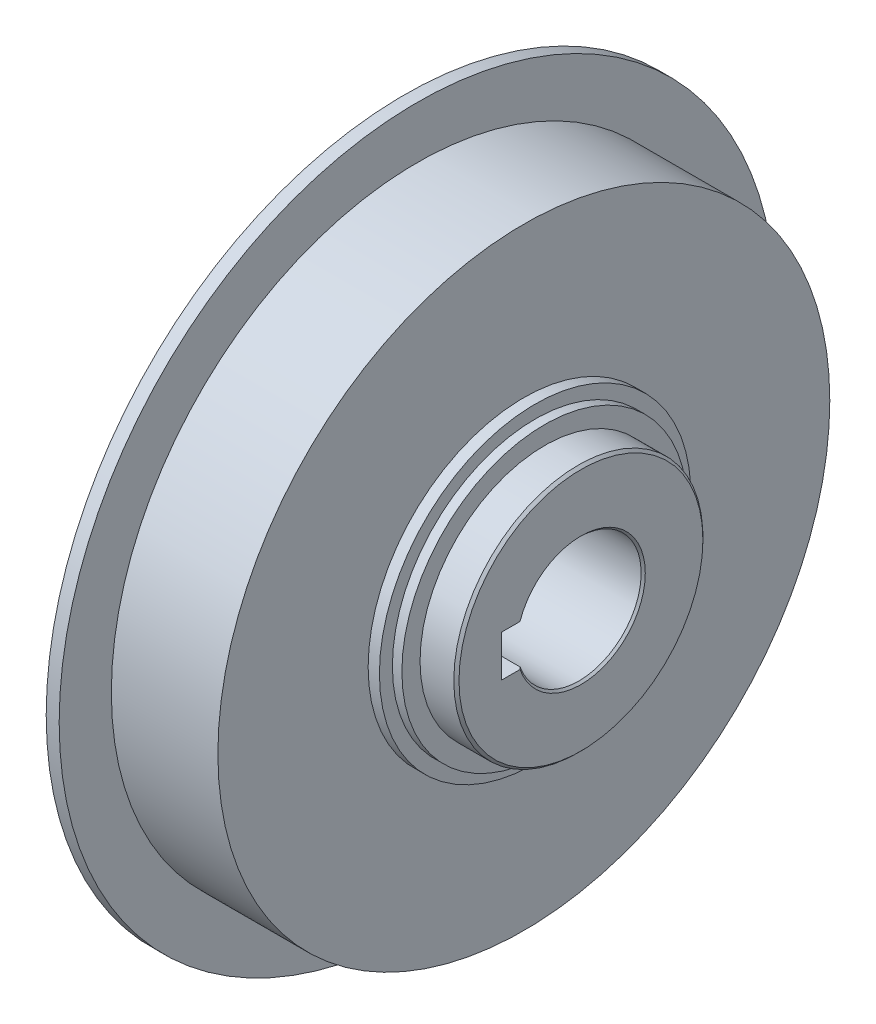
ISO-10303-21;
HEADER;
FILE_DESCRIPTION(('STEP AP214'),'2;1');
FILE_NAME('part.step','',(''),(''),'','','');
FILE_SCHEMA(('AUTOMOTIVE_DESIGN { 1 0 10303 214 1 1 1 1 }'));
ENDSEC;
DATA;
#1=APPLICATION_CONTEXT('core data for automotive mechanical design processes');
#2=APPLICATION_PROTOCOL_DEFINITION('international standard','automotive_design',2000,#1);
#3=PRODUCT_CONTEXT('',#1,'mechanical');
#4=PRODUCT('Part','Part','',(#3));
#5=PRODUCT_RELATED_PRODUCT_CATEGORY('part','',(#4));
#6=PRODUCT_DEFINITION_FORMATION('','',#4);
#7=PRODUCT_DEFINITION_CONTEXT('part definition',#1,'design');
#8=PRODUCT_DEFINITION('design','',#6,#7);
#9=PRODUCT_DEFINITION_SHAPE('','',#8);
#10=(LENGTH_UNIT() NAMED_UNIT(*) SI_UNIT(.MILLI.,.METRE.));
#11=(NAMED_UNIT(*) PLANE_ANGLE_UNIT() SI_UNIT($,.RADIAN.));
#12=(NAMED_UNIT(*) SI_UNIT($,.STERADIAN.) SOLID_ANGLE_UNIT());
#13=UNCERTAINTY_MEASURE_WITH_UNIT(LENGTH_MEASURE(1.E-05),#10,'distance_accuracy_value','');
#14=(GEOMETRIC_REPRESENTATION_CONTEXT(3) GLOBAL_UNCERTAINTY_ASSIGNED_CONTEXT((#13)) GLOBAL_UNIT_ASSIGNED_CONTEXT((#10,
#11,#12)) REPRESENTATION_CONTEXT('',''));
#15=CARTESIAN_POINT('',(0.,0.,0.));
#16=DIRECTION('',(0.,0.,1.));
#17=DIRECTION('',(1.,0.,0.));
#18=AXIS2_PLACEMENT_3D('',#15,#16,#17);
#19=CARTESIAN_POINT('',(83.1,0.,0.));
#20=DIRECTION('',(1.,0.,0.));
#21=DIRECTION('',(0.,0.,-1.));
#22=AXIS2_PLACEMENT_3D('',#19,#20,#21);
#23=CONICAL_SURFACE('',#22,12.4,0.78539816339744);
#24=CARTESIAN_POINT('',(82.7,0.,0.));
#25=DIRECTION('',(-1.,0.,0.));
#26=DIRECTION('',(0.,0.,1.));
#27=AXIS2_PLACEMENT_3D('',#24,#25,#26);
#28=CIRCLE('',#27,12.);
#29=CARTESIAN_POINT('',(82.7,4.,11.3137084989848));
#30=VERTEX_POINT('',#29);
#31=CARTESIAN_POINT('',(82.7,-4.,11.3137084989848));
#32=VERTEX_POINT('',#31);
#33=EDGE_CURVE('E79',#30,#32,#28,.T.);
#34=ORIENTED_EDGE('',*,*,#33,.T.);
#35=CARTESIAN_POINT('',(83.1,-4.,11.737120600897));
#36=CARTESIAN_POINT('',(83.0332637530497,-4.,11.6666176506962));
#37=CARTESIAN_POINT('',(82.9665622963739,-4.,11.5960818339105));
#38=CARTESIAN_POINT('',(82.83322896304,-4.,11.454944466607));
#39=CARTESIAN_POINT('',(82.7665970863825,-4.,11.3843429160886));
#40=CARTESIAN_POINT('',(82.7,-4.,11.3137084989848));
#41=B_SPLINE_CURVE_WITH_KNOTS('',3,(#35,#36,#37,#38,#39,#40),.UNSPECIFIED.,.F.,.F.,(4,2,4),(0.,
0.291237827128769,0.582475656578388),.UNSPECIFIED.);
#42=CARTESIAN_POINT('',(83.1,-4.,11.737120600897));
#43=VERTEX_POINT('',#42);
#44=EDGE_CURVE('E74',#43,#32,#41,.T.);
#45=ORIENTED_EDGE('',*,*,#44,.F.);
#46=CARTESIAN_POINT('',(83.1,0.,0.));
#47=DIRECTION('',(1.,0.,0.));
#48=DIRECTION('',(0.,0.,-1.));
#49=AXIS2_PLACEMENT_3D('',#46,#47,#48);
#50=CIRCLE('',#49,12.4);
#51=CARTESIAN_POINT('',(83.1,4.,11.737120600897));
#52=VERTEX_POINT('',#51);
#53=EDGE_CURVE('E72',#52,#43,#50,.F.);
#54=ORIENTED_EDGE('',*,*,#53,.F.);
#55=CARTESIAN_POINT('',(82.7,4.,11.3137084989848));
#56=CARTESIAN_POINT('',(82.7665970863825,4.,11.3843429160886));
#57=CARTESIAN_POINT('',(82.83322896304,4.,11.454944466607));
#58=CARTESIAN_POINT('',(82.9665622963739,4.,11.5960818339105));
#59=CARTESIAN_POINT('',(83.0332637530497,4.,11.6666176506962));
#60=CARTESIAN_POINT('',(83.1,4.,11.737120600897));
#61=B_SPLINE_CURVE_WITH_KNOTS('',3,(#55,#56,#57,#58,#59,#60),.UNSPECIFIED.,.F.,.F.,(4,2,4),(0.,
0.291237829449622,0.582475656578395),.UNSPECIFIED.);
#62=EDGE_CURVE('E20',#30,#52,#61,.T.);
#63=ORIENTED_EDGE('',*,*,#62,.F.);
#64=EDGE_LOOP('',(#34,#45,#54,#63));
#65=FACE_BOUND('',#64,.T.);
#66=ADVANCED_FACE('F16',(#65),#23,.F.);
#67=CARTESIAN_POINT('',(60.8,0.,0.));
#68=DIRECTION('',(-1.,0.,0.));
#69=DIRECTION('',(0.,0.,1.));
#70=AXIS2_PLACEMENT_3D('',#67,#68,#69);
#71=CYLINDRICAL_SURFACE('',#70,12.);
#72=ORIENTED_EDGE('',*,*,#33,.F.);
#73=DIRECTION('',(1.,0.,0.));
#74=VECTOR('',#73,1.);
#75=CARTESIAN_POINT('',(60.8,4.,11.3137084989848));
#76=LINE('',#75,#74);
#77=CARTESIAN_POINT('',(38.9,4.,11.3137084989848));
#78=VERTEX_POINT('',#77);
#79=EDGE_CURVE('E87',#78,#30,#76,.T.);
#80=ORIENTED_EDGE('',*,*,#79,.F.);
#81=CARTESIAN_POINT('',(38.9,0.,0.));
#82=DIRECTION('',(-1.,0.,0.));
#83=DIRECTION('',(0.,0.,1.));
#84=AXIS2_PLACEMENT_3D('',#81,#82,#83);
#85=CIRCLE('',#84,12.);
#86=CARTESIAN_POINT('',(38.9,-4.,11.3137084989848));
#87=VERTEX_POINT('',#86);
#88=EDGE_CURVE('E93',#78,#87,#85,.T.);
#89=ORIENTED_EDGE('',*,*,#88,.T.);
#90=DIRECTION('',(1.,0.,0.));
#91=VECTOR('',#90,1.);
#92=CARTESIAN_POINT('',(60.8,-4.,11.3137084989848));
#93=LINE('',#92,#91);
#94=EDGE_CURVE('E78',#32,#87,#93,.F.);
#95=ORIENTED_EDGE('',*,*,#94,.F.);
#96=EDGE_LOOP('',(#72,#80,#89,#95));
#97=FACE_BOUND('',#96,.T.);
#98=ADVANCED_FACE('F307',(#97),#71,.F.);
#99=CARTESIAN_POINT('',(83.1,0.,17.95));
#100=DIRECTION('',(1.,0.,0.));
#101=DIRECTION('',(0.,0.,-1.));
#102=AXIS2_PLACEMENT_3D('',#99,#100,#101);
#103=PLANE('',#102);
#104=DIRECTION('',(0.,0.,-1.));
#105=VECTOR('',#104,1.);
#106=CARTESIAN_POINT('',(83.1,4.,7.65));
#107=LINE('',#106,#105);
#108=CARTESIAN_POINT('',(83.1,4.,15.3));
#109=VERTEX_POINT('',#108);
#110=EDGE_CURVE('E84',#52,#109,#107,.F.);
#111=ORIENTED_EDGE('',*,*,#110,.F.);
#112=ORIENTED_EDGE('',*,*,#53,.T.);
#113=DIRECTION('',(0.,0.,1.));
#114=VECTOR('',#113,1.);
#115=CARTESIAN_POINT('',(83.1,-4.,7.65));
#116=LINE('',#115,#114);
#117=CARTESIAN_POINT('',(83.1,-4.,15.3));
#118=VERTEX_POINT('',#117);
#119=EDGE_CURVE('E109',#118,#43,#116,.F.);
#120=ORIENTED_EDGE('',*,*,#119,.F.);
#121=DIRECTION('',(0.,1.,0.));
#122=VECTOR('',#121,1.);
#123=CARTESIAN_POINT('',(83.1,0.,15.3));
#124=LINE('',#123,#122);
#125=EDGE_CURVE('E91',#118,#109,#124,.T.);
#126=ORIENTED_EDGE('',*,*,#125,.T.);
#127=EDGE_LOOP('',(#111,#112,#120,#126));
#128=FACE_BOUND('',#127,.T.);
#129=CARTESIAN_POINT('',(83.1,0.,0.));
#130=DIRECTION('',(-1.,0.,0.));
#131=DIRECTION('',(0.,0.,1.));
#132=AXIS2_PLACEMENT_3D('',#129,#130,#131);
#133=CIRCLE('',#132,23.5);
#134=CARTESIAN_POINT('',(83.1,0.,23.5));
#135=VERTEX_POINT('',#134);
#136=EDGE_CURVE('E148',#135,#135,#133,.T.);
#137=ORIENTED_EDGE('',*,*,#136,.F.);
#138=EDGE_LOOP('',(#137));
#139=FACE_BOUND('',#138,.T.);
#140=ADVANCED_FACE('F88',(#128,#139),#103,.T.);
#141=CARTESIAN_POINT('',(60.8,-4.,7.65));
#142=DIRECTION('',(0.,1.,0.));
#143=DIRECTION('',(0.,0.,1.));
#144=AXIS2_PLACEMENT_3D('',#141,#142,#143);
#145=PLANE('',#144);
#146=DIRECTION('',(1.,0.,0.));
#147=VECTOR('',#146,1.);
#148=CARTESIAN_POINT('',(60.8,-4.,15.3));
#149=LINE('',#148,#147);
#150=CARTESIAN_POINT('',(38.5,-4.,15.3));
#151=VERTEX_POINT('',#150);
#152=EDGE_CURVE('E383',#151,#118,#149,.T.);
#153=ORIENTED_EDGE('',*,*,#152,.T.);
#154=ORIENTED_EDGE('',*,*,#119,.T.);
#155=ORIENTED_EDGE('',*,*,#44,.T.);
#156=ORIENTED_EDGE('',*,*,#94,.T.);
#157=CARTESIAN_POINT('',(38.9,-4.,11.3137084989848));
#158=CARTESIAN_POINT('',(38.8334029136175,-4.,11.3843429160886));
#159=CARTESIAN_POINT('',(38.76677103696,-4.,11.454944466607));
#160=CARTESIAN_POINT('',(38.6334377036261,-4.,11.5960818339105));
#161=CARTESIAN_POINT('',(38.5667362469503,-4.,11.6666176506962));
#162=CARTESIAN_POINT('',(38.5,-4.,11.737120600897));
#163=B_SPLINE_CURVE_WITH_KNOTS('',3,(#157,#158,#159,#160,#161,#162),.UNSPECIFIED.,.F.,.F.,(4,2,
4),(0.,0.291237829449626,0.582475656578401),.UNSPECIFIED.);
#164=CARTESIAN_POINT('',(38.5,-4.,11.737120600897));
#165=VERTEX_POINT('',#164);
#166=EDGE_CURVE('E96',#87,#165,#163,.T.);
#167=ORIENTED_EDGE('',*,*,#166,.T.);
#168=DIRECTION('',(0.,0.,1.));
#169=VECTOR('',#168,1.);
#170=CARTESIAN_POINT('',(38.5,-4.,32.2625));
#171=LINE('',#170,#169);
#172=EDGE_CURVE('E147',#151,#165,#171,.F.);
#173=ORIENTED_EDGE('',*,*,#172,.F.);
#174=EDGE_LOOP('',(#153,#154,#155,#156,#167,#173));
#175=FACE_BOUND('',#174,.T.);
#176=ADVANCED_FACE('F294',(#175),#145,.T.);
#177=CARTESIAN_POINT('',(38.5,0.,0.));
#178=DIRECTION('',(-1.,0.,0.));
#179=DIRECTION('',(0.,0.,1.));
#180=AXIS2_PLACEMENT_3D('',#177,#178,#179);
#181=CONICAL_SURFACE('',#180,12.4,0.78539816339745);
#182=ORIENTED_EDGE('',*,*,#88,.F.);
#183=CARTESIAN_POINT('',(38.5,4.,11.737120600897));
#184=CARTESIAN_POINT('',(38.5667362469503,4.,11.6666176506962));
#185=CARTESIAN_POINT('',(38.6334377036261,4.,11.5960818339105));
#186=CARTESIAN_POINT('',(38.76677103696,4.,11.454944466607));
#187=CARTESIAN_POINT('',(38.8334029136175,4.,11.3843429160886));
#188=CARTESIAN_POINT('',(38.9,4.,11.3137084989848));
#189=B_SPLINE_CURVE_WITH_KNOTS('',3,(#183,#184,#185,#186,#187,#188),.UNSPECIFIED.,.F.,.F.,(4,2,
4),(0.,0.291237827128765,0.582475656578379),.UNSPECIFIED.);
#190=CARTESIAN_POINT('',(38.5,4.,11.737120600897));
#191=VERTEX_POINT('',#190);
#192=EDGE_CURVE('E92',#191,#78,#189,.T.);
#193=ORIENTED_EDGE('',*,*,#192,.F.);
#194=CARTESIAN_POINT('',(38.5,0.,0.));
#195=DIRECTION('',(-1.,0.,0.));
#196=DIRECTION('',(0.,0.,1.));
#197=AXIS2_PLACEMENT_3D('',#194,#195,#196);
#198=CIRCLE('',#197,12.4);
#199=EDGE_CURVE('E143',#165,#191,#198,.F.);
#200=ORIENTED_EDGE('',*,*,#199,.F.);
#201=ORIENTED_EDGE('',*,*,#166,.F.);
#202=EDGE_LOOP('',(#182,#193,#200,#201));
#203=FACE_BOUND('',#202,.T.);
#204=ADVANCED_FACE('F159',(#203),#181,.F.);
#205=CARTESIAN_POINT('',(60.8,4.,7.65));
#206=DIRECTION('',(0.,-1.,0.));
#207=DIRECTION('',(0.,0.,-1.));
#208=AXIS2_PLACEMENT_3D('',#205,#206,#207);
#209=PLANE('',#208);
#210=ORIENTED_EDGE('',*,*,#192,.T.);
#211=ORIENTED_EDGE('',*,*,#79,.T.);
#212=ORIENTED_EDGE('',*,*,#62,.T.);
#213=ORIENTED_EDGE('',*,*,#110,.T.);
#214=DIRECTION('',(1.,0.,0.));
#215=VECTOR('',#214,1.);
#216=CARTESIAN_POINT('',(60.8,4.,15.3));
#217=LINE('',#216,#215);
#218=CARTESIAN_POINT('',(38.5,4.,15.3));
#219=VERTEX_POINT('',#218);
#220=EDGE_CURVE('E39',#109,#219,#217,.F.);
#221=ORIENTED_EDGE('',*,*,#220,.T.);
#222=DIRECTION('',(0.,0.,1.));
#223=VECTOR('',#222,1.);
#224=CARTESIAN_POINT('',(38.5,4.,32.2625));
#225=LINE('',#224,#223);
#226=EDGE_CURVE('E146',#191,#219,#225,.T.);
#227=ORIENTED_EDGE('',*,*,#226,.F.);
#228=EDGE_LOOP('',(#210,#211,#212,#213,#221,#227));
#229=FACE_BOUND('',#228,.T.);
#230=ADVANCED_FACE('F83',(#229),#209,.T.);
#231=CARTESIAN_POINT('',(60.8,0.,15.3));
#232=DIRECTION('',(0.,0.,1.));
#233=DIRECTION('',(1.,0.,0.));
#234=AXIS2_PLACEMENT_3D('',#231,#232,#233);
#235=PLANE('',#234);
#236=ORIENTED_EDGE('',*,*,#152,.F.);
#237=DIRECTION('',(0.,1.,0.));
#238=VECTOR('',#237,1.);
#239=CARTESIAN_POINT('',(38.5,0.,15.3));
#240=LINE('',#239,#238);
#241=EDGE_CURVE('E391',#219,#151,#240,.F.);
#242=ORIENTED_EDGE('',*,*,#241,.F.);
#243=ORIENTED_EDGE('',*,*,#220,.F.);
#244=ORIENTED_EDGE('',*,*,#125,.F.);
#245=EDGE_LOOP('',(#236,#242,#243,#244));
#246=FACE_BOUND('',#245,.T.);
#247=ADVANCED_FACE('F164',(#246),#235,.F.);
#248=CARTESIAN_POINT('',(82.6,0.,0.));
#249=DIRECTION('',(-1.,0.,0.));
#250=DIRECTION('',(0.,0.,1.));
#251=AXIS2_PLACEMENT_3D('',#248,#249,#250);
#252=CONICAL_SURFACE('',#251,24.,0.785398163397448);
#253=ORIENTED_EDGE('',*,*,#136,.T.);
#254=EDGE_LOOP('',(#253));
#255=FACE_BOUND('',#254,.T.);
#256=CARTESIAN_POINT('',(82.6,0.,0.));
#257=DIRECTION('',(-1.,0.,0.));
#258=DIRECTION('',(0.,0.,1.));
#259=AXIS2_PLACEMENT_3D('',#256,#257,#258);
#260=CIRCLE('',#259,24.);
#261=CARTESIAN_POINT('',(82.6,0.,24.));
#262=VERTEX_POINT('',#261);
#263=EDGE_CURVE('E142',#262,#262,#260,.T.);
#264=ORIENTED_EDGE('',*,*,#263,.F.);
#265=EDGE_LOOP('',(#264));
#266=FACE_BOUND('',#265,.T.);
#267=ADVANCED_FACE('F168',(#255,#266),#252,.T.);
#268=CARTESIAN_POINT('',(38.5,0.,32.2625));
#269=DIRECTION('',(-1.,0.,0.));
#270=DIRECTION('',(0.,0.,1.));
#271=AXIS2_PLACEMENT_3D('',#268,#269,#270);
#272=PLANE('',#271);
#273=CARTESIAN_POINT('',(38.5,0.,0.));
#274=DIRECTION('',(-1.,0.,0.));
#275=DIRECTION('',(0.,0.,1.));
#276=AXIS2_PLACEMENT_3D('',#273,#274,#275);
#277=CIRCLE('',#276,52.125);
#278=CARTESIAN_POINT('',(38.5,0.,52.125));
#279=VERTEX_POINT('',#278);
#280=EDGE_CURVE('E139',#279,#279,#277,.F.);
#281=ORIENTED_EDGE('',*,*,#280,.F.);
#282=EDGE_LOOP('',(#281));
#283=FACE_BOUND('',#282,.T.);
#284=ORIENTED_EDGE('',*,*,#226,.T.);
#285=ORIENTED_EDGE('',*,*,#241,.T.);
#286=ORIENTED_EDGE('',*,*,#172,.T.);
#287=ORIENTED_EDGE('',*,*,#199,.T.);
#288=EDGE_LOOP('',(#284,#285,#286,#287));
#289=FACE_BOUND('',#288,.T.);
#290=ADVANCED_FACE('F172',(#283,#289),#272,.T.);
#291=CARTESIAN_POINT('',(79.35,0.,0.));
#292=DIRECTION('',(-1.,0.,0.));
#293=DIRECTION('',(0.,0.,1.));
#294=AXIS2_PLACEMENT_3D('',#291,#292,#293);
#295=CYLINDRICAL_SURFACE('',#294,24.);
#296=ORIENTED_EDGE('',*,*,#263,.T.);
#297=EDGE_LOOP('',(#296));
#298=FACE_BOUND('',#297,.T.);
#299=CARTESIAN_POINT('',(76.1,0.,0.));
#300=DIRECTION('',(-1.,0.,0.));
#301=DIRECTION('',(0.,0.,1.));
#302=AXIS2_PLACEMENT_3D('',#299,#300,#301);
#303=CIRCLE('',#302,24.);
#304=CARTESIAN_POINT('',(76.1,0.,24.));
#305=VERTEX_POINT('',#304);
#306=EDGE_CURVE('E136',#305,#305,#303,.T.);
#307=ORIENTED_EDGE('',*,*,#306,.F.);
#308=EDGE_LOOP('',(#307));
#309=FACE_BOUND('',#308,.T.);
#310=ADVANCED_FACE('F176',(#298,#309),#295,.T.);
#311=CARTESIAN_POINT('',(43.785,0.,0.));
#312=DIRECTION('',(-1.,0.,0.));
#313=DIRECTION('',(0.,0.,1.));
#314=AXIS2_PLACEMENT_3D('',#311,#312,#313);
#315=CYLINDRICAL_SURFACE('',#314,52.125);
#316=CARTESIAN_POINT('',(49.07,0.,0.));
#317=DIRECTION('',(-1.,0.,0.));
#318=DIRECTION('',(0.,0.,1.));
#319=AXIS2_PLACEMENT_3D('',#316,#317,#318);
#320=CIRCLE('',#319,52.125);
#321=CARTESIAN_POINT('',(49.07,0.,52.125));
#322=VERTEX_POINT('',#321);
#323=EDGE_CURVE('E133',#322,#322,#320,.F.);
#324=ORIENTED_EDGE('',*,*,#323,.F.);
#325=EDGE_LOOP('',(#324));
#326=FACE_BOUND('',#325,.T.);
#327=ORIENTED_EDGE('',*,*,#280,.T.);
#328=EDGE_LOOP('',(#327));
#329=FACE_BOUND('',#328,.T.);
#330=ADVANCED_FACE('F180',(#326,#329),#315,.T.);
#331=CARTESIAN_POINT('',(76.1,0.,25.75));
#332=DIRECTION('',(1.,0.,0.));
#333=DIRECTION('',(0.,0.,-1.));
#334=AXIS2_PLACEMENT_3D('',#331,#332,#333);
#335=PLANE('',#334);
#336=CARTESIAN_POINT('',(76.1,0.,0.));
#337=DIRECTION('',(-1.,0.,0.));
#338=DIRECTION('',(0.,0.,1.));
#339=AXIS2_PLACEMENT_3D('',#336,#337,#338);
#340=CIRCLE('',#339,27.5);
#341=CARTESIAN_POINT('',(76.1,0.,27.5));
#342=VERTEX_POINT('',#341);
#343=EDGE_CURVE('E130',#342,#342,#340,.T.);
#344=ORIENTED_EDGE('',*,*,#343,.F.);
#345=EDGE_LOOP('',(#344));
#346=FACE_BOUND('',#345,.T.);
#347=ORIENTED_EDGE('',*,*,#306,.T.);
#348=EDGE_LOOP('',(#347));
#349=FACE_BOUND('',#348,.T.);
#350=ADVANCED_FACE('F184',(#346,#349),#335,.T.);
#351=CARTESIAN_POINT('',(49.07,0.,60.5625));
#352=DIRECTION('',(-1.,0.,0.));
#353=DIRECTION('',(0.,0.,1.));
#354=AXIS2_PLACEMENT_3D('',#351,#352,#353);
#355=PLANE('',#354);
#356=ORIENTED_EDGE('',*,*,#323,.T.);
#357=EDGE_LOOP('',(#356));
#358=FACE_BOUND('',#357,.T.);
#359=CARTESIAN_POINT('',(49.07,0.,0.));
#360=DIRECTION('',(-1.,0.,0.));
#361=DIRECTION('',(0.,0.,1.));
#362=AXIS2_PLACEMENT_3D('',#359,#360,#361);
#363=CIRCLE('',#362,69.);
#364=CARTESIAN_POINT('',(49.07,0.,69.));
#365=VERTEX_POINT('',#364);
#366=EDGE_CURVE('E127',#365,#365,#363,.F.);
#367=ORIENTED_EDGE('',*,*,#366,.F.);
#368=EDGE_LOOP('',(#367));
#369=FACE_BOUND('',#368,.T.);
#370=ADVANCED_FACE('F188',(#358,#369),#355,.T.);
#371=CARTESIAN_POINT('',(75.185,0.,0.));
#372=DIRECTION('',(-1.,0.,0.));
#373=DIRECTION('',(0.,0.,1.));
#374=AXIS2_PLACEMENT_3D('',#371,#372,#373);
#375=CYLINDRICAL_SURFACE('',#374,27.5);
#376=ORIENTED_EDGE('',*,*,#343,.T.);
#377=EDGE_LOOP('',(#376));
#378=FACE_BOUND('',#377,.T.);
#379=CARTESIAN_POINT('',(74.27,0.,0.));
#380=DIRECTION('',(-1.,0.,0.));
#381=DIRECTION('',(0.,0.,1.));
#382=AXIS2_PLACEMENT_3D('',#379,#380,#381);
#383=CIRCLE('',#382,27.5);
#384=CARTESIAN_POINT('',(74.27,0.,27.5));
#385=VERTEX_POINT('',#384);
#386=EDGE_CURVE('E124',#385,#385,#383,.T.);
#387=ORIENTED_EDGE('',*,*,#386,.F.);
#388=EDGE_LOOP('',(#387));
#389=FACE_BOUND('',#388,.T.);
#390=ADVANCED_FACE('F192',(#378,#389),#375,.T.);
#391=CARTESIAN_POINT('',(50.32,0.,0.));
#392=DIRECTION('',(-1.,0.,0.));
#393=DIRECTION('',(0.,0.,1.));
#394=AXIS2_PLACEMENT_3D('',#391,#392,#393);
#395=CYLINDRICAL_SURFACE('',#394,69.);
#396=CARTESIAN_POINT('',(51.57,0.,0.));
#397=DIRECTION('',(-1.,0.,0.));
#398=DIRECTION('',(0.,0.,1.));
#399=AXIS2_PLACEMENT_3D('',#396,#397,#398);
#400=CIRCLE('',#399,69.);
#401=CARTESIAN_POINT('',(51.57,0.,69.));
#402=VERTEX_POINT('',#401);
#403=EDGE_CURVE('E121',#402,#402,#400,.F.);
#404=ORIENTED_EDGE('',*,*,#403,.F.);
#405=EDGE_LOOP('',(#404));
#406=FACE_BOUND('',#405,.T.);
#407=ORIENTED_EDGE('',*,*,#366,.T.);
#408=EDGE_LOOP('',(#407));
#409=FACE_BOUND('',#408,.T.);
#410=ADVANCED_FACE('F196',(#406,#409),#395,.T.);
#411=CARTESIAN_POINT('',(74.27,0.,28.75));
#412=DIRECTION('',(1.,0.,0.));
#413=DIRECTION('',(0.,0.,-1.));
#414=AXIS2_PLACEMENT_3D('',#411,#412,#413);
#415=PLANE('',#414);
#416=CARTESIAN_POINT('',(74.27,0.,0.));
#417=DIRECTION('',(-1.,0.,0.));
#418=DIRECTION('',(0.,0.,1.));
#419=AXIS2_PLACEMENT_3D('',#416,#417,#418);
#420=CIRCLE('',#419,30.);
#421=CARTESIAN_POINT('',(74.27,0.,30.));
#422=VERTEX_POINT('',#421);
#423=EDGE_CURVE('E118',#422,#422,#420,.T.);
#424=ORIENTED_EDGE('',*,*,#423,.F.);
#425=EDGE_LOOP('',(#424));
#426=FACE_BOUND('',#425,.T.);
#427=ORIENTED_EDGE('',*,*,#386,.T.);
#428=EDGE_LOOP('',(#427));
#429=FACE_BOUND('',#428,.T.);
#430=ADVANCED_FACE('F200',(#426,#429),#415,.T.);
#431=CARTESIAN_POINT('',(51.57,0.,63.975));
#432=DIRECTION('',(1.,0.,0.));
#433=DIRECTION('',(0.,0.,-1.));
#434=AXIS2_PLACEMENT_3D('',#431,#432,#433);
#435=PLANE('',#434);
#436=ORIENTED_EDGE('',*,*,#403,.T.);
#437=EDGE_LOOP('',(#436));
#438=FACE_BOUND('',#437,.T.);
#439=CARTESIAN_POINT('',(51.57,0.,0.));
#440=DIRECTION('',(-1.,0.,0.));
#441=DIRECTION('',(0.,0.,1.));
#442=AXIS2_PLACEMENT_3D('',#439,#440,#441);
#443=CIRCLE('',#442,58.95);
#444=CARTESIAN_POINT('',(51.57,0.,58.95));
#445=VERTEX_POINT('',#444);
#446=EDGE_CURVE('E115',#445,#445,#443,.F.);
#447=ORIENTED_EDGE('',*,*,#446,.F.);
#448=EDGE_LOOP('',(#447));
#449=FACE_BOUND('',#448,.T.);
#450=ADVANCED_FACE('F204',(#438,#449),#435,.T.);
#451=CARTESIAN_POINT('',(73.185,0.,0.));
#452=DIRECTION('',(-1.,0.,0.));
#453=DIRECTION('',(0.,0.,1.));
#454=AXIS2_PLACEMENT_3D('',#451,#452,#453);
#455=CYLINDRICAL_SURFACE('',#454,30.);
#456=ORIENTED_EDGE('',*,*,#423,.T.);
#457=EDGE_LOOP('',(#456));
#458=FACE_BOUND('',#457,.T.);
#459=CARTESIAN_POINT('',(72.1,0.,0.));
#460=DIRECTION('',(-1.,0.,0.));
#461=DIRECTION('',(0.,0.,1.));
#462=AXIS2_PLACEMENT_3D('',#459,#460,#461);
#463=CIRCLE('',#462,30.);
#464=CARTESIAN_POINT('',(72.1,0.,30.));
#465=VERTEX_POINT('',#464);
#466=EDGE_CURVE('E30',#465,#465,#463,.T.);
#467=ORIENTED_EDGE('',*,*,#466,.F.);
#468=EDGE_LOOP('',(#467));
#469=FACE_BOUND('',#468,.T.);
#470=ADVANCED_FACE('F208',(#458,#469),#455,.T.);
#471=CARTESIAN_POINT('',(61.835,0.,0.));
#472=DIRECTION('',(-1.,0.,0.));
#473=DIRECTION('',(0.,0.,1.));
#474=AXIS2_PLACEMENT_3D('',#471,#472,#473);
#475=CYLINDRICAL_SURFACE('',#474,58.95);
#476=CARTESIAN_POINT('',(72.1,0.,0.));
#477=DIRECTION('',(-1.,0.,0.));
#478=DIRECTION('',(0.,0.,1.));
#479=AXIS2_PLACEMENT_3D('',#476,#477,#478);
#480=CIRCLE('',#479,58.95);
#481=CARTESIAN_POINT('',(72.1,0.,58.95));
#482=VERTEX_POINT('',#481);
#483=EDGE_CURVE('E11',#482,#482,#480,.F.);
#484=ORIENTED_EDGE('',*,*,#483,.F.);
#485=EDGE_LOOP('',(#484));
#486=FACE_BOUND('',#485,.T.);
#487=ORIENTED_EDGE('',*,*,#446,.T.);
#488=EDGE_LOOP('',(#487));
#489=FACE_BOUND('',#488,.T.);
#490=ADVANCED_FACE('F212',(#486,#489),#475,.T.);
#491=CARTESIAN_POINT('',(72.1,0.,44.475));
#492=DIRECTION('',(1.,0.,0.));
#493=DIRECTION('',(0.,0.,-1.));
#494=AXIS2_PLACEMENT_3D('',#491,#492,#493);
#495=PLANE('',#494);
#496=ORIENTED_EDGE('',*,*,#483,.T.);
#497=EDGE_LOOP('',(#496));
#498=FACE_BOUND('',#497,.T.);
#499=ORIENTED_EDGE('',*,*,#466,.T.);
#500=EDGE_LOOP('',(#499));
#501=FACE_BOUND('',#500,.T.);
#502=ADVANCED_FACE('F216',(#498,#501),#495,.T.);
#503=CLOSED_SHELL('',(#66,#98,#140,#176,#204,#230,#247,#267,#290,#310,#330,#350,#370,#390,#410,
#430,#450,#470,#490,#502));
#504=MANIFOLD_SOLID_BREP('B1',#503);
#505=ADVANCED_BREP_SHAPE_REPRESENTATION('',(#18,#504),#14);
#506=SHAPE_DEFINITION_REPRESENTATION(#9,#505);
ENDSEC;
END-ISO-10303-21;
